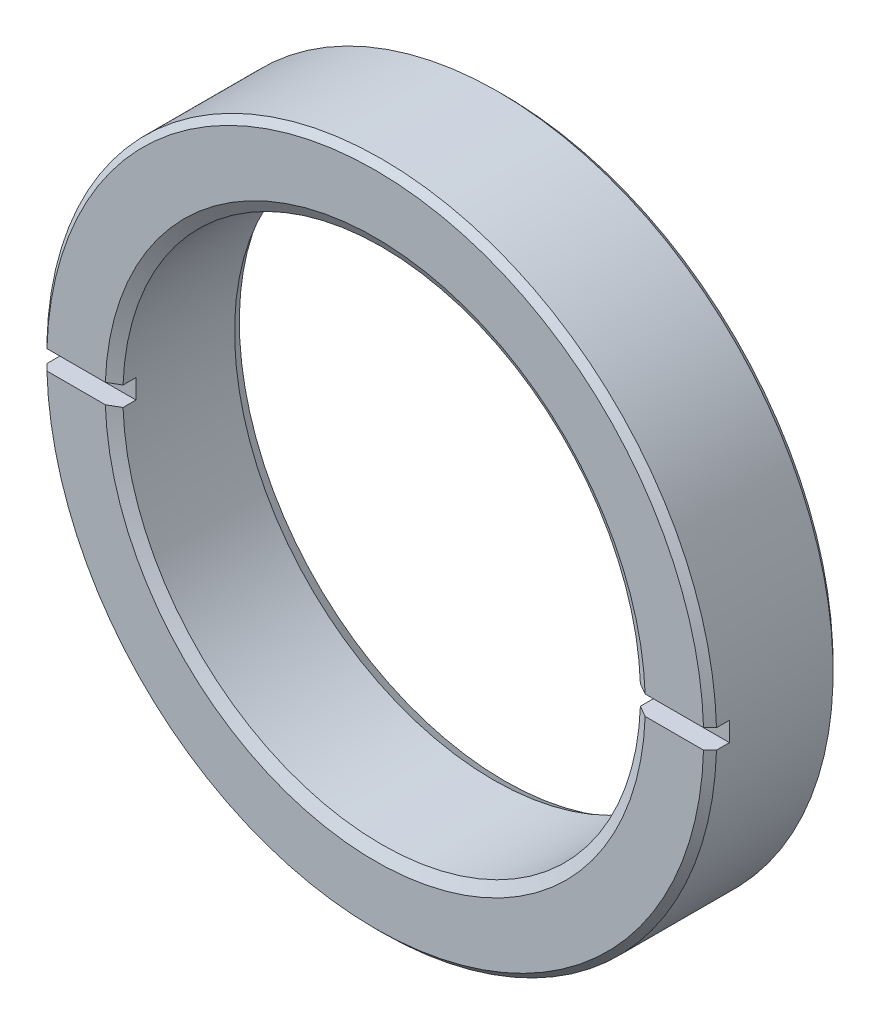
ISO-10303-21;
HEADER;
FILE_DESCRIPTION(('STEP AP214'),'2;1');
FILE_NAME('part.step','',(''),(''),'','','');
FILE_SCHEMA(('AUTOMOTIVE_DESIGN { 1 0 10303 214 1 1 1 1 }'));
ENDSEC;
DATA;
#1=APPLICATION_CONTEXT('core data for automotive mechanical design processes');
#2=APPLICATION_PROTOCOL_DEFINITION('international standard','automotive_design',2000,#1);
#3=PRODUCT_CONTEXT('',#1,'mechanical');
#4=PRODUCT('Part','Part','',(#3));
#5=PRODUCT_RELATED_PRODUCT_CATEGORY('part','',(#4));
#6=PRODUCT_DEFINITION_FORMATION('','',#4);
#7=PRODUCT_DEFINITION_CONTEXT('part definition',#1,'design');
#8=PRODUCT_DEFINITION('design','',#6,#7);
#9=PRODUCT_DEFINITION_SHAPE('','',#8);
#10=(LENGTH_UNIT() NAMED_UNIT(*) SI_UNIT(.MILLI.,.METRE.));
#11=(NAMED_UNIT(*) PLANE_ANGLE_UNIT() SI_UNIT($,.RADIAN.));
#12=(NAMED_UNIT(*) SI_UNIT($,.STERADIAN.) SOLID_ANGLE_UNIT());
#13=UNCERTAINTY_MEASURE_WITH_UNIT(LENGTH_MEASURE(1.E-05),#10,'distance_accuracy_value','');
#14=(GEOMETRIC_REPRESENTATION_CONTEXT(3) GLOBAL_UNCERTAINTY_ASSIGNED_CONTEXT((#13)) GLOBAL_UNIT_ASSIGNED_CONTEXT((#10,
#11,#12)) REPRESENTATION_CONTEXT('',''));
#15=CARTESIAN_POINT('',(0.,0.,0.));
#16=DIRECTION('',(0.,0.,1.));
#17=DIRECTION('',(1.,0.,0.));
#18=AXIS2_PLACEMENT_3D('',#15,#16,#17);
#19=CARTESIAN_POINT('',(0.,0.,-5.08));
#20=DIRECTION('',(0.,0.,1.));
#21=DIRECTION('',(0.,1.,0.));
#22=AXIS2_PLACEMENT_3D('',#19,#20,#21);
#23=CYLINDRICAL_SURFACE('',#22,13.1445);
#24=CARTESIAN_POINT('',(0.,0.,-4.826));
#25=DIRECTION('',(0.,0.,-1.));
#26=DIRECTION('',(0.,-1.,0.));
#27=AXIS2_PLACEMENT_3D('',#24,#25,#26);
#28=CIRCLE('',#27,13.1445);
#29=CARTESIAN_POINT('',(0.,-13.1445,-4.826));
#30=VERTEX_POINT('',#29);
#31=EDGE_CURVE('E171',#30,#30,#28,.F.);
#32=ORIENTED_EDGE('',*,*,#31,.T.);
#33=EDGE_LOOP('',(#32));
#34=FACE_BOUND('',#33,.T.);
#35=DIRECTION('',(0.,0.,1.));
#36=VECTOR('',#35,1.);
#37=CARTESIAN_POINT('',(13.1389771005965,-0.381000000000004,-0.762));
#38=LINE('',#37,#36);
#39=CARTESIAN_POINT('',(13.1389771005965,-0.381000000000004,-0.762));
#40=VERTEX_POINT('',#39);
#41=CARTESIAN_POINT('',(13.1389771005965,-0.381000000000004,-0.254000000000001));
#42=VERTEX_POINT('',#41);
#43=EDGE_CURVE('E162',#40,#42,#38,.T.);
#44=ORIENTED_EDGE('',*,*,#43,.T.);
#45=CARTESIAN_POINT('',(0.,0.,-0.253999999999999));
#46=DIRECTION('',(0.,0.,-1.));
#47=DIRECTION('',(0.,-1.,0.));
#48=AXIS2_PLACEMENT_3D('',#45,#46,#47);
#49=CIRCLE('',#48,13.1445);
#50=CARTESIAN_POINT('',(-13.1389771005965,-0.380999999999998,-0.254000000000001));
#51=VERTEX_POINT('',#50);
#52=EDGE_CURVE('E177',#42,#51,#49,.T.);
#53=ORIENTED_EDGE('',*,*,#52,.T.);
#54=DIRECTION('',(0.,0.,1.));
#55=VECTOR('',#54,1.);
#56=CARTESIAN_POINT('',(-13.1389771005965,-0.380999999999998,-0.762));
#57=LINE('',#56,#55);
#58=CARTESIAN_POINT('',(-13.1389771005965,-0.380999999999998,-0.762));
#59=VERTEX_POINT('',#58);
#60=EDGE_CURVE('E118',#59,#51,#57,.T.);
#61=ORIENTED_EDGE('',*,*,#60,.F.);
#62=CARTESIAN_POINT('',(0.,0.,-0.762));
#63=DIRECTION('',(0.,0.,-1.));
#64=DIRECTION('',(0.,-1.,0.));
#65=AXIS2_PLACEMENT_3D('',#62,#63,#64);
#66=CIRCLE('',#65,13.1445);
#67=CARTESIAN_POINT('',(-13.1389771005965,0.381000000000001,-0.762));
#68=VERTEX_POINT('',#67);
#69=EDGE_CURVE('E127',#59,#68,#66,.T.);
#70=ORIENTED_EDGE('',*,*,#69,.T.);
#71=DIRECTION('',(0.,0.,1.));
#72=VECTOR('',#71,1.);
#73=CARTESIAN_POINT('',(-13.1389771005965,0.381000000000001,-0.762));
#74=LINE('',#73,#72);
#75=CARTESIAN_POINT('',(-13.1389771005965,0.381000000000001,-0.254));
#76=VERTEX_POINT('',#75);
#77=EDGE_CURVE('E142',#68,#76,#74,.T.);
#78=ORIENTED_EDGE('',*,*,#77,.T.);
#79=CARTESIAN_POINT('',(0.,0.,-0.253999999999999));
#80=DIRECTION('',(0.,0.,-1.));
#81=DIRECTION('',(0.,-1.,0.));
#82=AXIS2_PLACEMENT_3D('',#79,#80,#81);
#83=CIRCLE('',#82,13.1445);
#84=CARTESIAN_POINT('',(13.1389771005965,0.380999999999995,-0.254));
#85=VERTEX_POINT('',#84);
#86=EDGE_CURVE('E174',#76,#85,#83,.T.);
#87=ORIENTED_EDGE('',*,*,#86,.T.);
#88=DIRECTION('',(0.,0.,1.));
#89=VECTOR('',#88,1.);
#90=CARTESIAN_POINT('',(13.1389771005965,0.380999999999995,-0.762));
#91=LINE('',#90,#89);
#92=CARTESIAN_POINT('',(13.1389771005965,0.380999999999995,-0.762));
#93=VERTEX_POINT('',#92);
#94=EDGE_CURVE('E165',#93,#85,#91,.T.);
#95=ORIENTED_EDGE('',*,*,#94,.F.);
#96=CARTESIAN_POINT('',(0.,0.,-0.762));
#97=DIRECTION('',(0.,0.,-1.));
#98=DIRECTION('',(0.,-1.,0.));
#99=AXIS2_PLACEMENT_3D('',#96,#97,#98);
#100=CIRCLE('',#99,13.1445);
#101=EDGE_CURVE('E151',#93,#40,#100,.T.);
#102=ORIENTED_EDGE('',*,*,#101,.T.);
#103=EDGE_LOOP('',(#44,#53,#61,#70,#78,#87,#95,#102));
#104=FACE_BOUND('',#103,.T.);
#105=ADVANCED_FACE('F16',(#34,#104),#23,.T.);
#106=CARTESIAN_POINT('',(0.,0.,-5.08));
#107=DIRECTION('',(0.,0.,1.));
#108=DIRECTION('',(0.,1.,0.));
#109=AXIS2_PLACEMENT_3D('',#106,#107,#108);
#110=CYLINDRICAL_SURFACE('',#109,10.16);
#111=CARTESIAN_POINT('',(0.,0.,-4.64005909487752));
#112=DIRECTION('',(0.,0.,-1.));
#113=DIRECTION('',(0.,-1.,0.));
#114=AXIS2_PLACEMENT_3D('',#111,#112,#113);
#115=CIRCLE('',#114,10.16);
#116=CARTESIAN_POINT('',(0.,-10.16,-4.64005909487752));
#117=VERTEX_POINT('',#116);
#118=EDGE_CURVE('E251',#117,#117,#115,.T.);
#119=ORIENTED_EDGE('',*,*,#118,.T.);
#120=EDGE_LOOP('',(#119));
#121=FACE_BOUND('',#120,.T.);
#122=DIRECTION('',(0.,0.,1.));
#123=VECTOR('',#122,1.);
#124=CARTESIAN_POINT('',(-10.152853736758,-0.380999999999998,-0.762));
#125=LINE('',#124,#123);
#126=CARTESIAN_POINT('',(-10.152853736758,-0.380999999999998,-0.762));
#127=VERTEX_POINT('',#126);
#128=CARTESIAN_POINT('',(-10.152853736758,-0.380999999999998,-0.254000000000002));
#129=VERTEX_POINT('',#128);
#130=EDGE_CURVE('E106',#127,#129,#125,.T.);
#131=ORIENTED_EDGE('',*,*,#130,.T.);
#132=CARTESIAN_POINT('',(0.,0.,-0.254000000000002));
#133=DIRECTION('',(0.,0.,-1.));
#134=DIRECTION('',(0.,-1.,0.));
#135=AXIS2_PLACEMENT_3D('',#132,#133,#134);
#136=CIRCLE('',#135,10.16);
#137=CARTESIAN_POINT('',(10.152853736758,-0.381000000000003,-0.254000000000002));
#138=VERTEX_POINT('',#137);
#139=EDGE_CURVE('E234',#129,#138,#136,.F.);
#140=ORIENTED_EDGE('',*,*,#139,.T.);
#141=DIRECTION('',(0.,0.,1.));
#142=VECTOR('',#141,1.);
#143=CARTESIAN_POINT('',(10.152853736758,-0.381000000000003,-0.762));
#144=LINE('',#143,#142);
#145=CARTESIAN_POINT('',(10.152853736758,-0.381000000000003,-0.762));
#146=VERTEX_POINT('',#145);
#147=EDGE_CURVE('E157',#146,#138,#144,.T.);
#148=ORIENTED_EDGE('',*,*,#147,.F.);
#149=CARTESIAN_POINT('',(0.,0.,-0.762));
#150=DIRECTION('',(0.,0.,-1.));
#151=DIRECTION('',(0.,-1.,0.));
#152=AXIS2_PLACEMENT_3D('',#149,#150,#151);
#153=CIRCLE('',#152,10.16);
#154=CARTESIAN_POINT('',(10.152853736758,0.380999999999996,-0.762));
#155=VERTEX_POINT('',#154);
#156=EDGE_CURVE('E146',#155,#146,#153,.T.);
#157=ORIENTED_EDGE('',*,*,#156,.F.);
#158=DIRECTION('',(0.,0.,1.));
#159=VECTOR('',#158,1.);
#160=CARTESIAN_POINT('',(10.152853736758,0.380999999999996,-0.762));
#161=LINE('',#160,#159);
#162=CARTESIAN_POINT('',(10.152853736758,0.380999999999996,-0.254000000000002));
#163=VERTEX_POINT('',#162);
#164=EDGE_CURVE('E168',#155,#163,#161,.T.);
#165=ORIENTED_EDGE('',*,*,#164,.T.);
#166=CARTESIAN_POINT('',(0.,0.,-0.254000000000002));
#167=DIRECTION('',(0.,0.,-1.));
#168=DIRECTION('',(0.,-1.,0.));
#169=AXIS2_PLACEMENT_3D('',#166,#167,#168);
#170=CIRCLE('',#169,10.16);
#171=CARTESIAN_POINT('',(-10.152853736758,0.381000000000001,-0.254000000000002));
#172=VERTEX_POINT('',#171);
#173=EDGE_CURVE('E255',#163,#172,#170,.F.);
#174=ORIENTED_EDGE('',*,*,#173,.T.);
#175=DIRECTION('',(0.,0.,1.));
#176=VECTOR('',#175,1.);
#177=CARTESIAN_POINT('',(-10.152853736758,0.381000000000001,-0.762));
#178=LINE('',#177,#176);
#179=CARTESIAN_POINT('',(-10.152853736758,0.381000000000001,-0.762));
#180=VERTEX_POINT('',#179);
#181=EDGE_CURVE('E131',#180,#172,#178,.T.);
#182=ORIENTED_EDGE('',*,*,#181,.F.);
#183=CARTESIAN_POINT('',(0.,0.,-0.762));
#184=DIRECTION('',(0.,0.,-1.));
#185=DIRECTION('',(0.,-1.,0.));
#186=AXIS2_PLACEMENT_3D('',#183,#184,#185);
#187=CIRCLE('',#186,10.16);
#188=EDGE_CURVE('E124',#127,#180,#187,.T.);
#189=ORIENTED_EDGE('',*,*,#188,.F.);
#190=EDGE_LOOP('',(#131,#140,#148,#157,#165,#174,#182,#189));
#191=FACE_BOUND('',#190,.T.);
#192=ADVANCED_FACE('F130',(#121,#191),#110,.F.);
#193=CARTESIAN_POINT('',(0.,-29.0593213562373,0.));
#194=DIRECTION('',(0.,0.,-1.));
#195=DIRECTION('',(0.,-1.,0.));
#196=AXIS2_PLACEMENT_3D('',#193,#194,#195);
#197=PLANE('',#196);
#198=DIRECTION('',(1.,0.,0.));
#199=VECTOR('',#198,1.);
#200=CARTESIAN_POINT('',(0.,-0.380999999999999,0.));
#201=LINE('',#200,#199);
#202=CARTESIAN_POINT('',(10.5930914369739,-0.381000000000003,0.));
#203=VERTEX_POINT('',#202);
#204=CARTESIAN_POINT('',(12.8848682278865,-0.381000000000004,0.));
#205=VERTEX_POINT('',#204);
#206=EDGE_CURVE('E149',#203,#205,#201,.T.);
#207=ORIENTED_EDGE('',*,*,#206,.F.);
#208=CARTESIAN_POINT('',(0.,0.,0.));
#209=DIRECTION('',(0.,0.,-1.));
#210=DIRECTION('',(0.,-1.,0.));
#211=AXIS2_PLACEMENT_3D('',#208,#209,#210);
#212=CIRCLE('',#211,10.5999409051225);
#213=CARTESIAN_POINT('',(-10.5930914369739,-0.380999999999998,0.));
#214=VERTEX_POINT('',#213);
#215=EDGE_CURVE('E252',#203,#214,#212,.T.);
#216=ORIENTED_EDGE('',*,*,#215,.T.);
#217=DIRECTION('',(-1.,0.,0.));
#218=VECTOR('',#217,1.);
#219=CARTESIAN_POINT('',(0.,-0.380999999999999,0.));
#220=LINE('',#219,#218);
#221=CARTESIAN_POINT('',(-12.8848682278865,-0.380999999999998,0.));
#222=VERTEX_POINT('',#221);
#223=EDGE_CURVE('E134',#214,#222,#220,.T.);
#224=ORIENTED_EDGE('',*,*,#223,.T.);
#225=CARTESIAN_POINT('',(0.,0.,0.));
#226=DIRECTION('',(0.,0.,-1.));
#227=DIRECTION('',(0.,-1.,0.));
#228=AXIS2_PLACEMENT_3D('',#225,#226,#227);
#229=CIRCLE('',#228,12.8905);
#230=EDGE_CURVE('E188',#222,#205,#229,.F.);
#231=ORIENTED_EDGE('',*,*,#230,.T.);
#232=EDGE_LOOP('',(#207,#216,#224,#231));
#233=FACE_BOUND('',#232,.T.);
#234=ADVANCED_FACE('F300',(#233),#197,.F.);
#235=DIRECTION('',(1.,0.,0.));
#236=VECTOR('',#235,1.);
#237=CARTESIAN_POINT('',(0.,0.380999999999999,0.));
#238=LINE('',#237,#236);
#239=CARTESIAN_POINT('',(-12.8848682278865,0.381000000000001,0.));
#240=VERTEX_POINT('',#239);
#241=CARTESIAN_POINT('',(-10.5930914369739,0.381000000000001,0.));
#242=VERTEX_POINT('',#241);
#243=EDGE_CURVE('E132',#240,#242,#238,.T.);
#244=ORIENTED_EDGE('',*,*,#243,.T.);
#245=CARTESIAN_POINT('',(0.,0.,0.));
#246=DIRECTION('',(0.,0.,-1.));
#247=DIRECTION('',(0.,-1.,0.));
#248=AXIS2_PLACEMENT_3D('',#245,#246,#247);
#249=CIRCLE('',#248,10.5999409051225);
#250=CARTESIAN_POINT('',(10.5930914369739,0.380999999999996,0.));
#251=VERTEX_POINT('',#250);
#252=EDGE_CURVE('E233',#242,#251,#249,.T.);
#253=ORIENTED_EDGE('',*,*,#252,.T.);
#254=DIRECTION('',(1.,0.,0.));
#255=VECTOR('',#254,1.);
#256=CARTESIAN_POINT('',(0.,0.380999999999999,0.));
#257=LINE('',#256,#255);
#258=CARTESIAN_POINT('',(12.8848682278865,0.380999999999995,0.));
#259=VERTEX_POINT('',#258);
#260=EDGE_CURVE('E117',#251,#259,#257,.T.);
#261=ORIENTED_EDGE('',*,*,#260,.T.);
#262=CARTESIAN_POINT('',(0.,0.,0.));
#263=DIRECTION('',(0.,0.,-1.));
#264=DIRECTION('',(0.,-1.,0.));
#265=AXIS2_PLACEMENT_3D('',#262,#263,#264);
#266=CIRCLE('',#265,12.8905);
#267=EDGE_CURVE('E269',#259,#240,#266,.F.);
#268=ORIENTED_EDGE('',*,*,#267,.T.);
#269=EDGE_LOOP('',(#244,#253,#261,#268));
#270=FACE_BOUND('',#269,.T.);
#271=ADVANCED_FACE('F288',(#270),#197,.F.);
#272=CARTESIAN_POINT('',(0.,-29.0593213562373,-5.08));
#273=DIRECTION('',(0.,0.,-1.));
#274=DIRECTION('',(0.,-1.,0.));
#275=AXIS2_PLACEMENT_3D('',#272,#273,#274);
#276=PLANE('',#275);
#277=CARTESIAN_POINT('',(0.,0.,-5.08));
#278=DIRECTION('',(0.,0.,-1.));
#279=DIRECTION('',(0.,-1.,0.));
#280=AXIS2_PLACEMENT_3D('',#277,#278,#279);
#281=CIRCLE('',#280,10.414);
#282=CARTESIAN_POINT('',(0.,-10.414,-5.08));
#283=VERTEX_POINT('',#282);
#284=EDGE_CURVE('E11',#283,#283,#281,.F.);
#285=ORIENTED_EDGE('',*,*,#284,.T.);
#286=EDGE_LOOP('',(#285));
#287=FACE_BOUND('',#286,.T.);
#288=CARTESIAN_POINT('',(0.,0.,-5.08));
#289=DIRECTION('',(0.,0.,-1.));
#290=DIRECTION('',(0.,-1.,0.));
#291=AXIS2_PLACEMENT_3D('',#288,#289,#290);
#292=CIRCLE('',#291,12.8905);
#293=CARTESIAN_POINT('',(0.,-12.8905,-5.08));
#294=VERTEX_POINT('',#293);
#295=EDGE_CURVE('E264',#294,#294,#292,.T.);
#296=ORIENTED_EDGE('',*,*,#295,.T.);
#297=EDGE_LOOP('',(#296));
#298=FACE_BOUND('',#297,.T.);
#299=ADVANCED_FACE('F360',(#287,#298),#276,.T.);
#300=CARTESIAN_POINT('',(0.,0.380999999999999,-0.762));
#301=DIRECTION('',(0.,-1.,0.));
#302=DIRECTION('',(-1.,0.,0.));
#303=AXIS2_PLACEMENT_3D('',#300,#301,#302);
#304=PLANE('',#303);
#305=ORIENTED_EDGE('',*,*,#260,.F.);
#306=CARTESIAN_POINT('',(10.5930914369739,0.380999999999996,0.));
#307=CARTESIAN_POINT('',(10.5197190110736,0.380999999999996,-0.0423342417752893));
#308=CARTESIAN_POINT('',(10.4463463231055,0.380999999999996,-0.0846680293295836));
#309=CARTESIAN_POINT('',(10.2996004230335,0.380999999999996,-0.169334695996251));
#310=CARTESIAN_POINT('',(10.2262272109296,0.380999999999996,-0.211667575108624));
#311=CARTESIAN_POINT('',(10.152853736758,0.380999999999996,-0.254000000000002));
#312=B_SPLINE_CURVE_WITH_KNOTS('',3,(#306,#307,#308,#309,#310,#311),.UNSPECIFIED.,.F.,.F.,(4,2,
4),(0.,0.254128526882005,0.508257053764425),.UNSPECIFIED.);
#313=EDGE_CURVE('E38',#251,#163,#312,.T.);
#314=ORIENTED_EDGE('',*,*,#313,.T.);
#315=ORIENTED_EDGE('',*,*,#164,.F.);
#316=DIRECTION('',(1.,0.,0.));
#317=VECTOR('',#316,1.);
#318=CARTESIAN_POINT('',(0.,0.380999999999999,-0.762));
#319=LINE('',#318,#317);
#320=EDGE_CURVE('E148',#155,#93,#319,.T.);
#321=ORIENTED_EDGE('',*,*,#320,.T.);
#322=ORIENTED_EDGE('',*,*,#94,.T.);
#323=CARTESIAN_POINT('',(13.1389771005965,0.380999999999995,-0.253999999999999));
#324=CARTESIAN_POINT('',(13.0966257988783,0.380999999999995,-0.21166648952405));
#325=CARTESIAN_POINT('',(13.0542744086266,0.380999999999995,-0.16933306761941));
#326=CARTESIAN_POINT('',(12.9695714510566,0.380999999999995,-0.0846664009527434));
#327=CARTESIAN_POINT('',(12.9272198837383,0.380999999999995,-0.042333156190717));
#328=CARTESIAN_POINT('',(12.8848682278865,0.380999999999995,0.));
#329=B_SPLINE_CURVE_WITH_KNOTS('',3,(#323,#324,#325,#326,#327,#328),.UNSPECIFIED.,.F.,.F.,(4,2,
4),(0.,0.179643618861412,0.359287237722838),.UNSPECIFIED.);
#330=EDGE_CURVE('E210',#85,#259,#329,.T.);
#331=ORIENTED_EDGE('',*,*,#330,.T.);
#332=EDGE_LOOP('',(#305,#314,#315,#321,#322,#331));
#333=FACE_BOUND('',#332,.T.);
#334=ADVANCED_FACE('F220',(#333),#304,.T.);
#335=CARTESIAN_POINT('',(0.,-0.380999999999999,-0.762));
#336=DIRECTION('',(0.,-1.,0.));
#337=DIRECTION('',(-1.,0.,0.));
#338=AXIS2_PLACEMENT_3D('',#335,#336,#337);
#339=PLANE('',#338);
#340=ORIENTED_EDGE('',*,*,#147,.T.);
#341=CARTESIAN_POINT('',(10.152853736758,-0.381000000000003,-0.254000000000002));
#342=CARTESIAN_POINT('',(10.2262272109296,-0.381000000000003,-0.211667575108624));
#343=CARTESIAN_POINT('',(10.2996004230335,-0.381000000000003,-0.169334695996251));
#344=CARTESIAN_POINT('',(10.4463463231055,-0.381000000000003,-0.0846680293295836));
#345=CARTESIAN_POINT('',(10.5197190110736,-0.381000000000003,-0.0423342417752894));
#346=CARTESIAN_POINT('',(10.5930914369739,-0.381000000000003,0.));
#347=B_SPLINE_CURVE_WITH_KNOTS('',3,(#341,#342,#343,#344,#345,#346),.UNSPECIFIED.,.F.,.F.,(4,2,
4),(0.,0.254128526882419,0.508257053764425),.UNSPECIFIED.);
#348=EDGE_CURVE('E226',#138,#203,#347,.T.);
#349=ORIENTED_EDGE('',*,*,#348,.T.);
#350=ORIENTED_EDGE('',*,*,#206,.T.);
#351=CARTESIAN_POINT('',(12.8848682278865,-0.381000000000004,0.));
#352=CARTESIAN_POINT('',(12.9272198837383,-0.381000000000004,-0.042333156190718));
#353=CARTESIAN_POINT('',(12.9695714510566,-0.381000000000004,-0.0846664009527445));
#354=CARTESIAN_POINT('',(13.0542744086266,-0.381000000000004,-0.169333067619411));
#355=CARTESIAN_POINT('',(13.0966257988783,-0.381000000000004,-0.211666489524051));
#356=CARTESIAN_POINT('',(13.1389771005965,-0.381000000000004,-0.253999999999999));
#357=B_SPLINE_CURVE_WITH_KNOTS('',3,(#351,#352,#353,#354,#355,#356),.UNSPECIFIED.,.F.,.F.,(4,2,
4),(0.,0.179643618861425,0.359287237722837),.UNSPECIFIED.);
#358=EDGE_CURVE('E204',#205,#42,#357,.T.);
#359=ORIENTED_EDGE('',*,*,#358,.T.);
#360=ORIENTED_EDGE('',*,*,#43,.F.);
#361=DIRECTION('',(1.,0.,0.));
#362=VECTOR('',#361,1.);
#363=CARTESIAN_POINT('',(0.,-0.380999999999999,-0.762));
#364=LINE('',#363,#362);
#365=EDGE_CURVE('E154',#146,#40,#364,.T.);
#366=ORIENTED_EDGE('',*,*,#365,.F.);
#367=EDGE_LOOP('',(#340,#349,#350,#359,#360,#366));
#368=FACE_BOUND('',#367,.T.);
#369=ADVANCED_FACE('F216',(#368),#339,.F.);
#370=CARTESIAN_POINT('',(0.,-29.0593213562373,-0.762));
#371=DIRECTION('',(0.,0.,-1.));
#372=DIRECTION('',(0.,-1.,0.));
#373=AXIS2_PLACEMENT_3D('',#370,#371,#372);
#374=PLANE('',#373);
#375=ORIENTED_EDGE('',*,*,#156,.T.);
#376=ORIENTED_EDGE('',*,*,#365,.T.);
#377=ORIENTED_EDGE('',*,*,#101,.F.);
#378=ORIENTED_EDGE('',*,*,#320,.F.);
#379=EDGE_LOOP('',(#375,#376,#377,#378));
#380=FACE_BOUND('',#379,.T.);
#381=ADVANCED_FACE('F219',(#380),#374,.F.);
#382=CARTESIAN_POINT('',(0.,-0.380999999999999,-0.762));
#383=DIRECTION('',(0.,1.,0.));
#384=DIRECTION('',(1.,0.,0.));
#385=AXIS2_PLACEMENT_3D('',#382,#383,#384);
#386=PLANE('',#385);
#387=ORIENTED_EDGE('',*,*,#223,.F.);
#388=CARTESIAN_POINT('',(-10.5930914369739,-0.380999999999998,0.));
#389=CARTESIAN_POINT('',(-10.5197190110736,-0.380999999999998,-0.0423342417752893));
#390=CARTESIAN_POINT('',(-10.4463463231055,-0.380999999999998,-0.0846680293295836));
#391=CARTESIAN_POINT('',(-10.2996004230335,-0.380999999999998,-0.169334695996251));
#392=CARTESIAN_POINT('',(-10.2262272109296,-0.380999999999998,-0.211667575108624));
#393=CARTESIAN_POINT('',(-10.152853736758,-0.380999999999998,-0.254000000000002));
#394=B_SPLINE_CURVE_WITH_KNOTS('',3,(#388,#389,#390,#391,#392,#393),.UNSPECIFIED.,.F.,.F.,(4,2,
4),(0.,0.254128526882005,0.508257053764425),.UNSPECIFIED.);
#395=EDGE_CURVE('E113',#214,#129,#394,.T.);
#396=ORIENTED_EDGE('',*,*,#395,.T.);
#397=ORIENTED_EDGE('',*,*,#130,.F.);
#398=DIRECTION('',(-1.,0.,0.));
#399=VECTOR('',#398,1.);
#400=CARTESIAN_POINT('',(0.,-0.380999999999999,-0.762));
#401=LINE('',#400,#399);
#402=EDGE_CURVE('E111',#127,#59,#401,.T.);
#403=ORIENTED_EDGE('',*,*,#402,.T.);
#404=ORIENTED_EDGE('',*,*,#60,.T.);
#405=CARTESIAN_POINT('',(-13.1389771005965,-0.380999999999998,-0.253999999999999));
#406=CARTESIAN_POINT('',(-13.0966257988783,-0.380999999999998,-0.21166648952405));
#407=CARTESIAN_POINT('',(-13.0542744086266,-0.380999999999998,-0.16933306761941));
#408=CARTESIAN_POINT('',(-12.9695714510566,-0.380999999999998,-0.0846664009527434));
#409=CARTESIAN_POINT('',(-12.9272198837383,-0.380999999999998,-0.0423331561907172));
#410=CARTESIAN_POINT('',(-12.8848682278865,-0.380999999999998,0.));
#411=B_SPLINE_CURVE_WITH_KNOTS('',3,(#405,#406,#407,#408,#409,#410),.UNSPECIFIED.,.F.,.F.,(4,2,
4),(0.,0.179643618861411,0.359287237722837),.UNSPECIFIED.);
#412=EDGE_CURVE('E180',#51,#222,#411,.T.);
#413=ORIENTED_EDGE('',*,*,#412,.T.);
#414=EDGE_LOOP('',(#387,#396,#397,#403,#404,#413));
#415=FACE_BOUND('',#414,.T.);
#416=ADVANCED_FACE('F109',(#415),#386,.T.);
#417=CARTESIAN_POINT('',(0.,0.380999999999999,-0.762));
#418=DIRECTION('',(0.,-1.,0.));
#419=DIRECTION('',(-1.,0.,0.));
#420=AXIS2_PLACEMENT_3D('',#417,#418,#419);
#421=PLANE('',#420);
#422=ORIENTED_EDGE('',*,*,#181,.T.);
#423=CARTESIAN_POINT('',(-10.152853736758,0.381000000000001,-0.254000000000002));
#424=CARTESIAN_POINT('',(-10.2262272109296,0.381000000000001,-0.211667575108624));
#425=CARTESIAN_POINT('',(-10.2996004230335,0.381000000000001,-0.169334695996251));
#426=CARTESIAN_POINT('',(-10.4463463231055,0.381000000000001,-0.0846680293295836));
#427=CARTESIAN_POINT('',(-10.5197190110736,0.381000000000001,-0.0423342417752894));
#428=CARTESIAN_POINT('',(-10.5930914369739,0.381000000000001,0.));
#429=B_SPLINE_CURVE_WITH_KNOTS('',3,(#423,#424,#425,#426,#427,#428),.UNSPECIFIED.,.F.,.F.,(4,2,
4),(0.,0.254128526882419,0.508257053764425),.UNSPECIFIED.);
#430=EDGE_CURVE('E24',#172,#242,#429,.T.);
#431=ORIENTED_EDGE('',*,*,#430,.T.);
#432=ORIENTED_EDGE('',*,*,#243,.F.);
#433=CARTESIAN_POINT('',(-12.8848682278865,0.381000000000001,0.));
#434=CARTESIAN_POINT('',(-12.9272198837383,0.381000000000001,-0.0423331561907182));
#435=CARTESIAN_POINT('',(-12.9695714510566,0.381000000000001,-0.0846664009527447));
#436=CARTESIAN_POINT('',(-13.0542744086266,0.381000000000001,-0.169333067619411));
#437=CARTESIAN_POINT('',(-13.0966257988783,0.381000000000001,-0.211666489524051));
#438=CARTESIAN_POINT('',(-13.1389771005965,0.381000000000001,-0.253999999999999));
#439=B_SPLINE_CURVE_WITH_KNOTS('',3,(#433,#434,#435,#436,#437,#438),.UNSPECIFIED.,.F.,.F.,(4,2,
4),(0.,0.179643618861426,0.359287237722838),.UNSPECIFIED.);
#440=EDGE_CURVE('E266',#240,#76,#439,.T.);
#441=ORIENTED_EDGE('',*,*,#440,.T.);
#442=ORIENTED_EDGE('',*,*,#77,.F.);
#443=DIRECTION('',(1.,0.,0.));
#444=VECTOR('',#443,1.);
#445=CARTESIAN_POINT('',(0.,0.380999999999999,-0.762));
#446=LINE('',#445,#444);
#447=EDGE_CURVE('E138',#68,#180,#446,.T.);
#448=ORIENTED_EDGE('',*,*,#447,.T.);
#449=EDGE_LOOP('',(#422,#431,#432,#441,#442,#448));
#450=FACE_BOUND('',#449,.T.);
#451=ADVANCED_FACE('F274',(#450),#421,.T.);
#452=CARTESIAN_POINT('',(0.,-29.0593213562373,-0.762));
#453=DIRECTION('',(0.,0.,-1.));
#454=DIRECTION('',(0.,-1.,0.));
#455=AXIS2_PLACEMENT_3D('',#452,#453,#454);
#456=PLANE('',#455);
#457=ORIENTED_EDGE('',*,*,#188,.T.);
#458=ORIENTED_EDGE('',*,*,#447,.F.);
#459=ORIENTED_EDGE('',*,*,#69,.F.);
#460=ORIENTED_EDGE('',*,*,#402,.F.);
#461=EDGE_LOOP('',(#457,#458,#459,#460));
#462=FACE_BOUND('',#461,.T.);
#463=ADVANCED_FACE('F122',(#462),#456,.F.);
#464=CARTESIAN_POINT('',(0.,0.,-0.253999999999999));
#465=DIRECTION('',(0.,0.,-1.));
#466=DIRECTION('',(0.,-1.,0.));
#467=AXIS2_PLACEMENT_3D('',#464,#465,#466);
#468=CONICAL_SURFACE('',#467,13.1445,0.785398163397452);
#469=ORIENTED_EDGE('',*,*,#358,.F.);
#470=ORIENTED_EDGE('',*,*,#230,.F.);
#471=ORIENTED_EDGE('',*,*,#412,.F.);
#472=ORIENTED_EDGE('',*,*,#52,.F.);
#473=EDGE_LOOP('',(#469,#470,#471,#472));
#474=FACE_BOUND('',#473,.T.);
#475=ADVANCED_FACE('F193',(#474),#468,.T.);
#476=CARTESIAN_POINT('',(0.,0.,-0.253999999999999));
#477=DIRECTION('',(0.,0.,-1.));
#478=DIRECTION('',(0.,-1.,0.));
#479=AXIS2_PLACEMENT_3D('',#476,#477,#478);
#480=CONICAL_SURFACE('',#479,13.1445,0.785398163397452);
#481=ORIENTED_EDGE('',*,*,#440,.F.);
#482=ORIENTED_EDGE('',*,*,#267,.F.);
#483=ORIENTED_EDGE('',*,*,#330,.F.);
#484=ORIENTED_EDGE('',*,*,#86,.F.);
#485=EDGE_LOOP('',(#481,#482,#483,#484));
#486=FACE_BOUND('',#485,.T.);
#487=ADVANCED_FACE('F198',(#486),#480,.T.);
#488=CARTESIAN_POINT('',(0.,0.,-5.08));
#489=DIRECTION('',(0.,0.,1.));
#490=DIRECTION('',(0.,1.,0.));
#491=AXIS2_PLACEMENT_3D('',#488,#489,#490);
#492=CONICAL_SURFACE('',#491,12.8905,0.785398163397452);
#493=ORIENTED_EDGE('',*,*,#31,.F.);
#494=EDGE_LOOP('',(#493));
#495=FACE_BOUND('',#494,.T.);
#496=ORIENTED_EDGE('',*,*,#295,.F.);
#497=EDGE_LOOP('',(#496));
#498=FACE_BOUND('',#497,.T.);
#499=ADVANCED_FACE('F241',(#495,#498),#492,.T.);
#500=CARTESIAN_POINT('',(0.,0.,0.));
#501=DIRECTION('',(0.,0.,1.));
#502=DIRECTION('',(0.,1.,0.));
#503=AXIS2_PLACEMENT_3D('',#500,#501,#502);
#504=CONICAL_SURFACE('',#503,10.5999409051225,1.04719755119659);
#505=ORIENTED_EDGE('',*,*,#348,.F.);
#506=ORIENTED_EDGE('',*,*,#139,.F.);
#507=ORIENTED_EDGE('',*,*,#395,.F.);
#508=ORIENTED_EDGE('',*,*,#215,.F.);
#509=EDGE_LOOP('',(#505,#506,#507,#508));
#510=FACE_BOUND('',#509,.T.);
#511=ADVANCED_FACE('F237',(#510),#504,.F.);
#512=CARTESIAN_POINT('',(0.,0.,0.));
#513=DIRECTION('',(0.,0.,1.));
#514=DIRECTION('',(0.,1.,0.));
#515=AXIS2_PLACEMENT_3D('',#512,#513,#514);
#516=CONICAL_SURFACE('',#515,10.5999409051225,1.04719755119659);
#517=ORIENTED_EDGE('',*,*,#430,.F.);
#518=ORIENTED_EDGE('',*,*,#173,.F.);
#519=ORIENTED_EDGE('',*,*,#313,.F.);
#520=ORIENTED_EDGE('',*,*,#252,.F.);
#521=EDGE_LOOP('',(#517,#518,#519,#520));
#522=FACE_BOUND('',#521,.T.);
#523=ADVANCED_FACE('F240',(#522),#516,.F.);
#524=CARTESIAN_POINT('',(0.,0.,-4.64005909487752));
#525=DIRECTION('',(0.,0.,-1.));
#526=DIRECTION('',(0.,-1.,0.));
#527=AXIS2_PLACEMENT_3D('',#524,#525,#526);
#528=CONICAL_SURFACE('',#527,10.16,0.523598775598296);
#529=ORIENTED_EDGE('',*,*,#284,.F.);
#530=EDGE_LOOP('',(#529));
#531=FACE_BOUND('',#530,.T.);
#532=ORIENTED_EDGE('',*,*,#118,.F.);
#533=EDGE_LOOP('',(#532));
#534=FACE_BOUND('',#533,.T.);
#535=ADVANCED_FACE('F18',(#531,#534),#528,.F.);
#536=CLOSED_SHELL('',(#105,#192,#234,#271,#299,#334,#369,#381,#416,#451,#463,#475,#487,#499,
#511,#523,#535));
#537=MANIFOLD_SOLID_BREP('B1',#536);
#538=ADVANCED_BREP_SHAPE_REPRESENTATION('',(#18,#537),#14);
#539=SHAPE_DEFINITION_REPRESENTATION(#9,#538);
ENDSEC;
END-ISO-10303-21;
